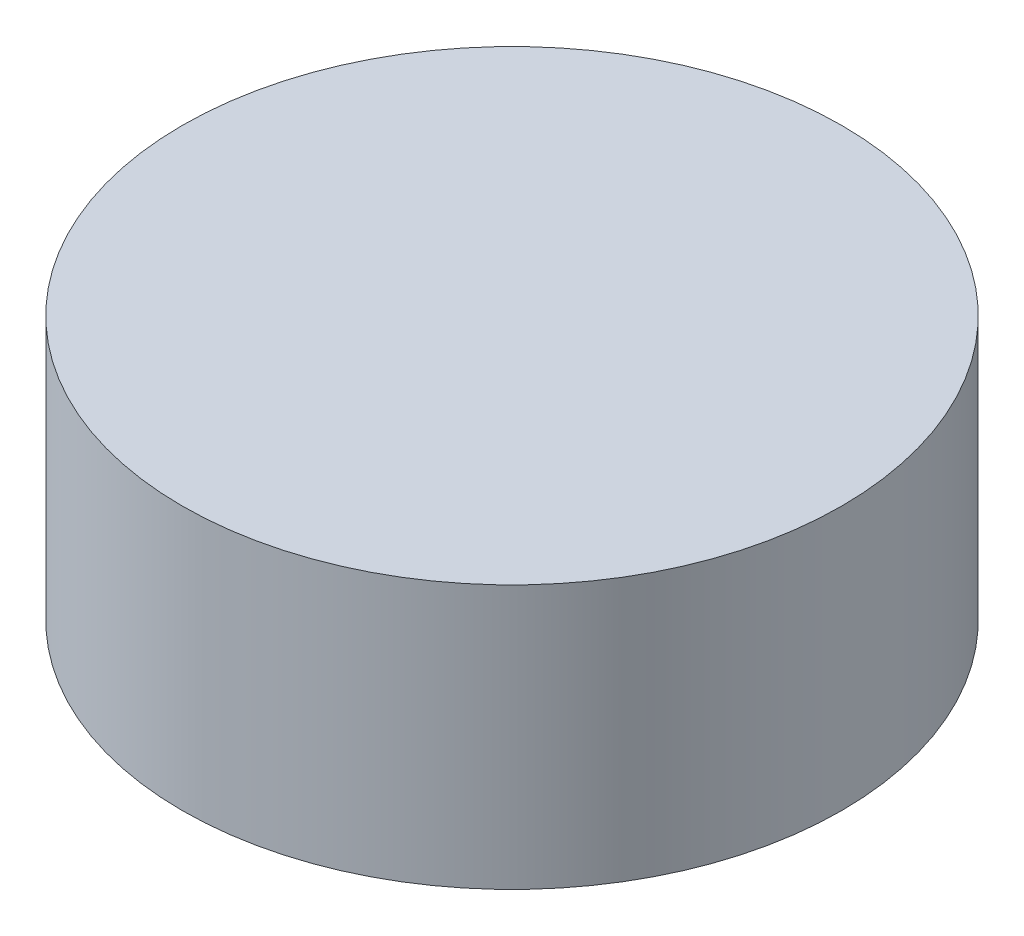
ISO-10303-21;
HEADER;
FILE_DESCRIPTION(('STEP AP214'),'2;1');
FILE_NAME('part.step','',(''),(''),'','','');
FILE_SCHEMA(('AUTOMOTIVE_DESIGN { 1 0 10303 214 1 1 1 1 }'));
ENDSEC;
DATA;
#1=APPLICATION_CONTEXT('core data for automotive mechanical design processes');
#2=APPLICATION_PROTOCOL_DEFINITION('international standard','automotive_design',2000,#1);
#3=PRODUCT_CONTEXT('',#1,'mechanical');
#4=PRODUCT('Part','Part','',(#3));
#5=PRODUCT_RELATED_PRODUCT_CATEGORY('part','',(#4));
#6=PRODUCT_DEFINITION_FORMATION('','',#4);
#7=PRODUCT_DEFINITION_CONTEXT('part definition',#1,'design');
#8=PRODUCT_DEFINITION('design','',#6,#7);
#9=PRODUCT_DEFINITION_SHAPE('','',#8);
#10=(LENGTH_UNIT() NAMED_UNIT(*) SI_UNIT(.MILLI.,.METRE.));
#11=(NAMED_UNIT(*) PLANE_ANGLE_UNIT() SI_UNIT($,.RADIAN.));
#12=(NAMED_UNIT(*) SI_UNIT($,.STERADIAN.) SOLID_ANGLE_UNIT());
#13=UNCERTAINTY_MEASURE_WITH_UNIT(LENGTH_MEASURE(1.E-05),#10,'distance_accuracy_value','');
#14=(GEOMETRIC_REPRESENTATION_CONTEXT(3) GLOBAL_UNCERTAINTY_ASSIGNED_CONTEXT((#13)) GLOBAL_UNIT_ASSIGNED_CONTEXT((#10,
#11,#12)) REPRESENTATION_CONTEXT('',''));
#15=CARTESIAN_POINT('',(0.,0.,0.));
#16=DIRECTION('',(0.,0.,1.));
#17=DIRECTION('',(1.,0.,0.));
#18=AXIS2_PLACEMENT_3D('',#15,#16,#17);
#19=CARTESIAN_POINT('',(0.,20.,0.));
#20=DIRECTION('',(0.,-1.,0.));
#21=DIRECTION('',(0.,0.,-1.));
#22=AXIS2_PLACEMENT_3D('',#19,#20,#21);
#23=CYLINDRICAL_SURFACE('',#22,25.);
#24=CARTESIAN_POINT('',(0.,20.,0.));
#25=DIRECTION('',(0.,1.,0.));
#26=DIRECTION('',(0.,0.,1.));
#27=AXIS2_PLACEMENT_3D('',#24,#25,#26);
#28=CIRCLE('',#27,25.);
#29=CARTESIAN_POINT('',(0.,20.,25.));
#30=VERTEX_POINT('',#29);
#31=EDGE_CURVE('E10',#30,#30,#28,.T.);
#32=ORIENTED_EDGE('',*,*,#31,.F.);
#33=EDGE_LOOP('',(#32));
#34=FACE_BOUND('',#33,.T.);
#35=CARTESIAN_POINT('',(0.,0.,0.));
#36=DIRECTION('',(0.,1.,0.));
#37=DIRECTION('',(0.,0.,1.));
#38=AXIS2_PLACEMENT_3D('',#35,#36,#37);
#39=CIRCLE('',#38,25.);
#40=CARTESIAN_POINT('',(0.,0.,25.));
#41=VERTEX_POINT('',#40);
#42=EDGE_CURVE('E35',#41,#41,#39,.T.);
#43=ORIENTED_EDGE('',*,*,#42,.T.);
#44=EDGE_LOOP('',(#43));
#45=FACE_BOUND('',#44,.T.);
#46=ADVANCED_FACE('F32',(#34,#45),#23,.T.);
#47=CARTESIAN_POINT('',(0.,20.,0.));
#48=DIRECTION('',(0.,1.,0.));
#49=DIRECTION('',(0.,0.,1.));
#50=AXIS2_PLACEMENT_3D('',#47,#48,#49);
#51=PLANE('',#50);
#52=ORIENTED_EDGE('',*,*,#31,.T.);
#53=EDGE_LOOP('',(#52));
#54=FACE_BOUND('',#53,.T.);
#55=ADVANCED_FACE('F47',(#54),#51,.T.);
#56=CARTESIAN_POINT('',(0.,0.,0.));
#57=DIRECTION('',(0.,1.,0.));
#58=DIRECTION('',(0.,0.,1.));
#59=AXIS2_PLACEMENT_3D('',#56,#57,#58);
#60=PLANE('',#59);
#61=ORIENTED_EDGE('',*,*,#42,.F.);
#62=EDGE_LOOP('',(#61));
#63=FACE_BOUND('',#62,.T.);
#64=ADVANCED_FACE('F45',(#63),#60,.F.);
#65=CLOSED_SHELL('',(#46,#55,#64));
#66=MANIFOLD_SOLID_BREP('B2',#65);
#67=ADVANCED_BREP_SHAPE_REPRESENTATION('',(#18,#66),#14);
#68=SHAPE_DEFINITION_REPRESENTATION(#9,#67);
ENDSEC;
END-ISO-10303-21;
